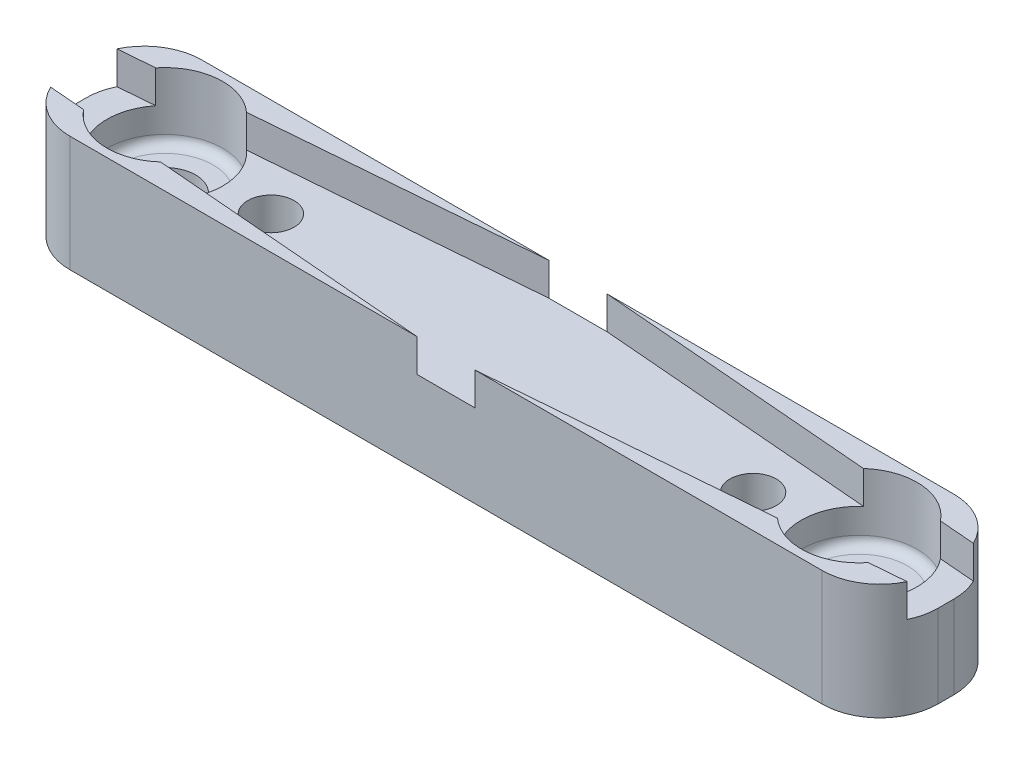
ISO-10303-21;
HEADER;
FILE_DESCRIPTION(('STEP AP214'),'2;1');
FILE_NAME('part.step','',(''),(''),'','','');
FILE_SCHEMA(('AUTOMOTIVE_DESIGN { 1 0 10303 214 1 1 1 1 }'));
ENDSEC;
DATA;
#1=APPLICATION_CONTEXT('core data for automotive mechanical design processes');
#2=APPLICATION_PROTOCOL_DEFINITION('international standard','automotive_design',2000,#1);
#3=PRODUCT_CONTEXT('',#1,'mechanical');
#4=PRODUCT('Part','Part','',(#3));
#5=PRODUCT_RELATED_PRODUCT_CATEGORY('part','',(#4));
#6=PRODUCT_DEFINITION_FORMATION('','',#4);
#7=PRODUCT_DEFINITION_CONTEXT('part definition',#1,'design');
#8=PRODUCT_DEFINITION('design','',#6,#7);
#9=PRODUCT_DEFINITION_SHAPE('','',#8);
#10=(LENGTH_UNIT() NAMED_UNIT(*) SI_UNIT(.MILLI.,.METRE.));
#11=(NAMED_UNIT(*) PLANE_ANGLE_UNIT() SI_UNIT($,.RADIAN.));
#12=(NAMED_UNIT(*) SI_UNIT($,.STERADIAN.) SOLID_ANGLE_UNIT());
#13=UNCERTAINTY_MEASURE_WITH_UNIT(LENGTH_MEASURE(1.E-05),#10,'distance_accuracy_value','');
#14=(GEOMETRIC_REPRESENTATION_CONTEXT(3) GLOBAL_UNCERTAINTY_ASSIGNED_CONTEXT((#13)) GLOBAL_UNIT_ASSIGNED_CONTEXT((#10,
#11,#12)) REPRESENTATION_CONTEXT('',''));
#15=CARTESIAN_POINT('',(0.,0.,0.));
#16=DIRECTION('',(0.,0.,1.));
#17=DIRECTION('',(1.,0.,0.));
#18=AXIS2_PLACEMENT_3D('',#15,#16,#17);
#19=CARTESIAN_POINT('',(-18.,6.,4.50000000346947));
#20=DIRECTION('',(0.,-1.,0.));
#21=DIRECTION('',(0.,0.,-1.));
#22=AXIS2_PLACEMENT_3D('',#19,#20,#21);
#23=CYLINDRICAL_SURFACE('',#22,1.6);
#24=CARTESIAN_POINT('',(-18.,0.,4.50000000346947));
#25=DIRECTION('',(0.,1.,0.));
#26=DIRECTION('',(0.,0.,1.));
#27=AXIS2_PLACEMENT_3D('',#24,#25,#26);
#28=CIRCLE('',#27,1.6);
#29=CARTESIAN_POINT('',(-18.,0.,6.10000000346947));
#30=VERTEX_POINT('',#29);
#31=EDGE_CURVE('E275',#30,#30,#28,.T.);
#32=ORIENTED_EDGE('',*,*,#31,.F.);
#33=EDGE_LOOP('',(#32));
#34=FACE_BOUND('',#33,.T.);
#35=CARTESIAN_POINT('',(-18.,2.5,4.50000000346947));
#36=DIRECTION('',(0.,1.,0.));
#37=DIRECTION('',(0.,0.,1.));
#38=AXIS2_PLACEMENT_3D('',#35,#36,#37);
#39=CIRCLE('',#38,1.6);
#40=CARTESIAN_POINT('',(-18.,2.5,6.10000000346947));
#41=VERTEX_POINT('',#40);
#42=EDGE_CURVE('E361',#41,#41,#39,.T.);
#43=ORIENTED_EDGE('',*,*,#42,.T.);
#44=EDGE_LOOP('',(#43));
#45=FACE_BOUND('',#44,.T.);
#46=ADVANCED_FACE('F36',(#34,#45),#23,.F.);
#47=CARTESIAN_POINT('',(18.,6.,4.50000000346948));
#48=DIRECTION('',(0.,-1.,0.));
#49=DIRECTION('',(0.,0.,-1.));
#50=AXIS2_PLACEMENT_3D('',#47,#48,#49);
#51=CYLINDRICAL_SURFACE('',#50,1.6);
#52=CARTESIAN_POINT('',(18.,0.,4.50000000346948));
#53=DIRECTION('',(0.,1.,0.));
#54=DIRECTION('',(0.,0.,-1.));
#55=AXIS2_PLACEMENT_3D('',#52,#53,#54);
#56=CIRCLE('',#55,1.6);
#57=CARTESIAN_POINT('',(18.,0.,2.90000000346948));
#58=VERTEX_POINT('',#57);
#59=EDGE_CURVE('E272',#58,#58,#56,.T.);
#60=ORIENTED_EDGE('',*,*,#59,.F.);
#61=EDGE_LOOP('',(#60));
#62=FACE_BOUND('',#61,.T.);
#63=CARTESIAN_POINT('',(18.,2.5,4.50000000346948));
#64=DIRECTION('',(0.,1.,0.));
#65=DIRECTION('',(0.,0.,1.));
#66=AXIS2_PLACEMENT_3D('',#63,#64,#65);
#67=CIRCLE('',#66,1.6);
#68=CARTESIAN_POINT('',(18.,2.5,6.10000000346948));
#69=VERTEX_POINT('',#68);
#70=EDGE_CURVE('E358',#69,#69,#67,.T.);
#71=ORIENTED_EDGE('',*,*,#70,.T.);
#72=EDGE_LOOP('',(#71));
#73=FACE_BOUND('',#72,.T.);
#74=ADVANCED_FACE('F399',(#62,#73),#51,.F.);
#75=CARTESIAN_POINT('',(0.,4.3,0.953841045118482));
#76=DIRECTION('',(0.0820399469741276,0.,-0.996629041870887));
#77=DIRECTION('',(-0.996629041870887,0.,-0.0820399469741276));
#78=AXIS2_PLACEMENT_3D('',#75,#76,#77);
#79=PLANE('',#78);
#80=DIRECTION('',(0.,-1.,0.));
#81=VECTOR('',#80,1.);
#82=CARTESIAN_POINT('',(20.3447254159373,6.,2.62856666940238));
#83=LINE('',#82,#81);
#84=CARTESIAN_POINT('',(20.3447254159373,4.3,2.62856666940238));
#85=VERTEX_POINT('',#84);
#86=CARTESIAN_POINT('',(20.3447254159373,6.,2.62856666940238));
#87=VERTEX_POINT('',#86);
#88=EDGE_CURVE('E212',#85,#87,#83,.F.);
#89=ORIENTED_EDGE('',*,*,#88,.F.);
#90=DIRECTION('',(-0.996629041870887,0.,-0.0820399469741276));
#91=VECTOR('',#90,1.);
#92=CARTESIAN_POINT('',(0.,4.3,0.953841045118482));
#93=LINE('',#92,#91);
#94=CARTESIAN_POINT('',(22.2051959465598,4.3,2.78171583249788));
#95=VERTEX_POINT('',#94);
#96=EDGE_CURVE('E603',#95,#85,#93,.T.);
#97=ORIENTED_EDGE('',*,*,#96,.F.);
#98=DIRECTION('',(0.,-1.,0.));
#99=VECTOR('',#98,1.);
#100=CARTESIAN_POINT('',(22.2051959465598,6.,2.78171583249788));
#101=LINE('',#100,#99);
#102=CARTESIAN_POINT('',(22.2051959465598,6.,2.78171583249788));
#103=VERTEX_POINT('',#102);
#104=EDGE_CURVE('E350',#95,#103,#101,.F.);
#105=ORIENTED_EDGE('',*,*,#104,.T.);
#106=DIRECTION('',(-0.996629041870887,0.,-0.0820399469741276));
#107=VECTOR('',#106,1.);
#108=CARTESIAN_POINT('',(0.,6.,0.953841045118482));
#109=LINE('',#108,#107);
#110=EDGE_CURVE('E566',#103,#87,#109,.T.);
#111=ORIENTED_EDGE('',*,*,#110,.T.);
#112=EDGE_LOOP('',(#89,#97,#105,#111));
#113=FACE_BOUND('',#112,.T.);
#114=ADVANCED_FACE('F405',(#113),#79,.F.);
#115=DIRECTION('',(0.,-1.,0.));
#116=VECTOR('',#115,1.);
#117=CARTESIAN_POINT('',(15.9928666620891,6.,2.27033281667982));
#118=LINE('',#117,#116);
#119=CARTESIAN_POINT('',(15.9928666620891,6.,2.27033281667982));
#120=VERTEX_POINT('',#119);
#121=CARTESIAN_POINT('',(15.9928666620891,4.3,2.27033281667982));
#122=VERTEX_POINT('',#121);
#123=EDGE_CURVE('E614',#120,#122,#118,.T.);
#124=ORIENTED_EDGE('',*,*,#123,.F.);
#125=CARTESIAN_POINT('',(1.51561331942348,6.,1.07860244693893));
#126=VERTEX_POINT('',#125);
#127=EDGE_CURVE('E365',#120,#126,#109,.T.);
#128=ORIENTED_EDGE('',*,*,#127,.T.);
#129=DIRECTION('',(0.,1.,0.));
#130=VECTOR('',#129,1.);
#131=CARTESIAN_POINT('',(1.51561331942346,6.,1.07860244693893));
#132=LINE('',#131,#130);
#133=CARTESIAN_POINT('',(1.51561331942348,4.3,1.07860244693893));
#134=VERTEX_POINT('',#133);
#135=EDGE_CURVE('E262',#134,#126,#132,.T.);
#136=ORIENTED_EDGE('',*,*,#135,.F.);
#137=EDGE_CURVE('E222',#122,#134,#93,.T.);
#138=ORIENTED_EDGE('',*,*,#137,.F.);
#139=EDGE_LOOP('',(#124,#128,#136,#138));
#140=FACE_BOUND('',#139,.T.);
#141=ADVANCED_FACE('F497',(#140),#79,.F.);
#142=CARTESIAN_POINT('',(43.079074710979,4.3,4.50000000346946));
#143=DIRECTION('',(0.0820399469741276,0.,0.996629041870887));
#144=DIRECTION('',(0.996629041870887,0.,-0.0820399469741276));
#145=AXIS2_PLACEMENT_3D('',#142,#143,#144);
#146=PLANE('',#145);
#147=DIRECTION('',(0.,-1.,0.));
#148=VECTOR('',#147,1.);
#149=CARTESIAN_POINT('',(15.992866662089,6.,6.72966719025912));
#150=LINE('',#149,#148);
#151=CARTESIAN_POINT('',(15.992866662089,4.3,6.72966719025912));
#152=VERTEX_POINT('',#151);
#153=CARTESIAN_POINT('',(15.992866662089,6.,6.72966719025912));
#154=VERTEX_POINT('',#153);
#155=EDGE_CURVE('E198',#152,#154,#150,.F.);
#156=ORIENTED_EDGE('',*,*,#155,.F.);
#157=DIRECTION('',(0.996629041870887,0.,-0.0820399469741276));
#158=VECTOR('',#157,1.);
#159=CARTESIAN_POINT('',(43.079074710979,4.3,4.50000000346946));
#160=LINE('',#159,#158);
#161=CARTESIAN_POINT('',(1.51561331942313,4.3,7.92139756000002));
#162=VERTEX_POINT('',#161);
#163=EDGE_CURVE('E232',#162,#152,#160,.T.);
#164=ORIENTED_EDGE('',*,*,#163,.F.);
#165=DIRECTION('',(0.,-1.,0.));
#166=VECTOR('',#165,1.);
#167=CARTESIAN_POINT('',(1.51561331942338,6.,7.92139756000001));
#168=LINE('',#167,#166);
#169=CARTESIAN_POINT('',(1.51561331942313,6.,7.92139756000002));
#170=VERTEX_POINT('',#169);
#171=EDGE_CURVE('E259',#170,#162,#168,.T.);
#172=ORIENTED_EDGE('',*,*,#171,.F.);
#173=DIRECTION('',(0.996629041870887,0.,-0.0820399469741276));
#174=VECTOR('',#173,1.);
#175=CARTESIAN_POINT('',(43.079074710979,6.,4.50000000346946));
#176=LINE('',#175,#174);
#177=EDGE_CURVE('E219',#170,#154,#176,.T.);
#178=ORIENTED_EDGE('',*,*,#177,.T.);
#179=EDGE_LOOP('',(#156,#164,#172,#178));
#180=FACE_BOUND('',#179,.T.);
#181=ADVANCED_FACE('F494',(#180),#146,.F.);
#182=DIRECTION('',(0.,-1.,0.));
#183=VECTOR('',#182,1.);
#184=CARTESIAN_POINT('',(20.3447254159373,6.,6.37143333753655));
#185=LINE('',#184,#183);
#186=CARTESIAN_POINT('',(20.3447254159373,6.,6.37143333753655));
#187=VERTEX_POINT('',#186);
#188=CARTESIAN_POINT('',(20.3447254159373,4.3,6.37143333753655));
#189=VERTEX_POINT('',#188);
#190=EDGE_CURVE('E59',#187,#189,#185,.T.);
#191=ORIENTED_EDGE('',*,*,#190,.F.);
#192=CARTESIAN_POINT('',(22.2051959465598,6.,6.21828417444105));
#193=VERTEX_POINT('',#192);
#194=EDGE_CURVE('E209',#187,#193,#176,.T.);
#195=ORIENTED_EDGE('',*,*,#194,.T.);
#196=DIRECTION('',(0.,-1.,0.));
#197=VECTOR('',#196,1.);
#198=CARTESIAN_POINT('',(22.2051959465598,6.,6.21828417444105));
#199=LINE('',#198,#197);
#200=CARTESIAN_POINT('',(22.2051959465598,4.3,6.21828417444105));
#201=VERTEX_POINT('',#200);
#202=EDGE_CURVE('E348',#193,#201,#199,.T.);
#203=ORIENTED_EDGE('',*,*,#202,.T.);
#204=EDGE_CURVE('E211',#189,#201,#160,.T.);
#205=ORIENTED_EDGE('',*,*,#204,.F.);
#206=EDGE_LOOP('',(#191,#195,#203,#205));
#207=FACE_BOUND('',#206,.T.);
#208=ADVANCED_FACE('F207',(#207),#146,.F.);
#209=CARTESIAN_POINT('',(0.,4.3,8.04615896182045));
#210=DIRECTION('',(-0.0820399469741273,0.,0.996629041870887));
#211=DIRECTION('',(0.996629041870887,0.,0.0820399469741273));
#212=AXIS2_PLACEMENT_3D('',#209,#210,#211);
#213=PLANE('',#212);
#214=DIRECTION('',(0.,-1.,0.));
#215=VECTOR('',#214,1.);
#216=CARTESIAN_POINT('',(-20.3447254159373,6.,6.37143333753655));
#217=LINE('',#216,#215);
#218=CARTESIAN_POINT('',(-20.3447254159373,4.3,6.37143333753655));
#219=VERTEX_POINT('',#218);
#220=CARTESIAN_POINT('',(-20.3447254159373,6.,6.37143333753655));
#221=VERTEX_POINT('',#220);
#222=EDGE_CURVE('E362',#219,#221,#217,.F.);
#223=ORIENTED_EDGE('',*,*,#222,.F.);
#224=DIRECTION('',(0.996629041870887,0.,0.0820399469741273));
#225=VECTOR('',#224,1.);
#226=CARTESIAN_POINT('',(0.,4.3,8.04615896182045));
#227=LINE('',#226,#225);
#228=CARTESIAN_POINT('',(-22.2051959465598,4.3,6.21828417444106));
#229=VERTEX_POINT('',#228);
#230=EDGE_CURVE('E557',#229,#219,#227,.T.);
#231=ORIENTED_EDGE('',*,*,#230,.F.);
#232=DIRECTION('',(0.,-1.,0.));
#233=VECTOR('',#232,1.);
#234=CARTESIAN_POINT('',(-22.2051959465598,6.,6.21828417444106));
#235=LINE('',#234,#233);
#236=CARTESIAN_POINT('',(-22.2051959465598,6.,6.21828417444106));
#237=VERTEX_POINT('',#236);
#238=EDGE_CURVE('E346',#229,#237,#235,.F.);
#239=ORIENTED_EDGE('',*,*,#238,.T.);
#240=DIRECTION('',(0.996629041870887,0.,0.0820399469741273));
#241=VECTOR('',#240,1.);
#242=CARTESIAN_POINT('',(0.,6.,8.04615896182045));
#243=LINE('',#242,#241);
#244=EDGE_CURVE('E220',#237,#221,#243,.T.);
#245=ORIENTED_EDGE('',*,*,#244,.T.);
#246=EDGE_LOOP('',(#223,#231,#239,#245));
#247=FACE_BOUND('',#246,.T.);
#248=ADVANCED_FACE('F499',(#247),#213,.F.);
#249=DIRECTION('',(0.,-1.,0.));
#250=VECTOR('',#249,1.);
#251=CARTESIAN_POINT('',(-15.9928666620891,6.,6.72966719025912));
#252=LINE('',#251,#250);
#253=CARTESIAN_POINT('',(-15.9928666620891,6.,6.72966719025912));
#254=VERTEX_POINT('',#253);
#255=CARTESIAN_POINT('',(-15.9928666620891,4.3,6.72966719025912));
#256=VERTEX_POINT('',#255);
#257=EDGE_CURVE('E51',#254,#256,#252,.T.);
#258=ORIENTED_EDGE('',*,*,#257,.F.);
#259=CARTESIAN_POINT('',(-1.51561331942348,6.,7.92139756));
#260=VERTEX_POINT('',#259);
#261=EDGE_CURVE('E224',#254,#260,#243,.T.);
#262=ORIENTED_EDGE('',*,*,#261,.T.);
#263=DIRECTION('',(0.,1.,0.));
#264=VECTOR('',#263,1.);
#265=CARTESIAN_POINT('',(-1.51561331942337,6.,7.92139756000001));
#266=LINE('',#265,#264);
#267=CARTESIAN_POINT('',(-1.51561331942348,4.3,7.92139756));
#268=VERTEX_POINT('',#267);
#269=EDGE_CURVE('E256',#268,#260,#266,.T.);
#270=ORIENTED_EDGE('',*,*,#269,.F.);
#271=EDGE_CURVE('E550',#256,#268,#227,.T.);
#272=ORIENTED_EDGE('',*,*,#271,.F.);
#273=EDGE_LOOP('',(#258,#262,#270,#272));
#274=FACE_BOUND('',#273,.T.);
#275=ADVANCED_FACE('F502',(#274),#213,.F.);
#276=CARTESIAN_POINT('',(-43.079074710979,4.3,4.50000000346948));
#277=DIRECTION('',(-0.082039946974128,0.,-0.996629041870887));
#278=DIRECTION('',(-0.996629041870887,0.,0.082039946974128));
#279=AXIS2_PLACEMENT_3D('',#276,#277,#278);
#280=PLANE('',#279);
#281=DIRECTION('',(0.,-1.,0.));
#282=VECTOR('',#281,1.);
#283=CARTESIAN_POINT('',(-15.9928666620891,6.,2.27033281667982));
#284=LINE('',#283,#282);
#285=CARTESIAN_POINT('',(-15.9928666620891,4.3,2.27033281667982));
#286=VERTEX_POINT('',#285);
#287=CARTESIAN_POINT('',(-15.9928666620891,6.,2.27033281667982));
#288=VERTEX_POINT('',#287);
#289=EDGE_CURVE('E613',#286,#288,#284,.F.);
#290=ORIENTED_EDGE('',*,*,#289,.F.);
#291=DIRECTION('',(-0.996629041870887,0.,0.082039946974128));
#292=VECTOR('',#291,1.);
#293=CARTESIAN_POINT('',(-43.079074710979,4.3,4.50000000346948));
#294=LINE('',#293,#292);
#295=CARTESIAN_POINT('',(-1.51561331942383,4.3,1.07860244693895));
#296=VERTEX_POINT('',#295);
#297=EDGE_CURVE('E553',#296,#286,#294,.T.);
#298=ORIENTED_EDGE('',*,*,#297,.F.);
#299=DIRECTION('',(0.,-1.,0.));
#300=VECTOR('',#299,1.);
#301=CARTESIAN_POINT('',(-1.51561331942346,6.,1.07860244693893));
#302=LINE('',#301,#300);
#303=CARTESIAN_POINT('',(-1.51561331942383,6.,1.07860244693895));
#304=VERTEX_POINT('',#303);
#305=EDGE_CURVE('E253',#304,#296,#302,.T.);
#306=ORIENTED_EDGE('',*,*,#305,.F.);
#307=DIRECTION('',(-0.996629041870887,0.,0.082039946974128));
#308=VECTOR('',#307,1.);
#309=CARTESIAN_POINT('',(-43.079074710979,6.,4.50000000346948));
#310=LINE('',#309,#308);
#311=EDGE_CURVE('E569',#304,#288,#310,.T.);
#312=ORIENTED_EDGE('',*,*,#311,.T.);
#313=EDGE_LOOP('',(#290,#298,#306,#312));
#314=FACE_BOUND('',#313,.T.);
#315=ADVANCED_FACE('F504',(#314),#280,.F.);
#316=DIRECTION('',(0.,-1.,0.));
#317=VECTOR('',#316,1.);
#318=CARTESIAN_POINT('',(-20.3447254159373,6.,2.62856666940239));
#319=LINE('',#318,#317);
#320=CARTESIAN_POINT('',(-20.3447254159373,6.,2.62856666940239));
#321=VERTEX_POINT('',#320);
#322=CARTESIAN_POINT('',(-20.3447254159373,4.3,2.62856666940239));
#323=VERTEX_POINT('',#322);
#324=EDGE_CURVE('E578',#321,#323,#319,.T.);
#325=ORIENTED_EDGE('',*,*,#324,.F.);
#326=CARTESIAN_POINT('',(-22.2051959465598,6.,2.78171583249789));
#327=VERTEX_POINT('',#326);
#328=EDGE_CURVE('E568',#321,#327,#310,.T.);
#329=ORIENTED_EDGE('',*,*,#328,.T.);
#330=DIRECTION('',(0.,-1.,0.));
#331=VECTOR('',#330,1.);
#332=CARTESIAN_POINT('',(-22.2051959465598,6.,2.78171583249789));
#333=LINE('',#332,#331);
#334=CARTESIAN_POINT('',(-22.2051959465598,4.3,2.78171583249789));
#335=VERTEX_POINT('',#334);
#336=EDGE_CURVE('E343',#327,#335,#333,.T.);
#337=ORIENTED_EDGE('',*,*,#336,.T.);
#338=EDGE_CURVE('E560',#323,#335,#294,.T.);
#339=ORIENTED_EDGE('',*,*,#338,.F.);
#340=EDGE_LOOP('',(#325,#329,#337,#339));
#341=FACE_BOUND('',#340,.T.);
#342=ADVANCED_FACE('F507',(#341),#280,.F.);
#343=CARTESIAN_POINT('',(0.,4.3,0.));
#344=DIRECTION('',(0.,-1.,0.));
#345=DIRECTION('',(0.,0.,-1.));
#346=AXIS2_PLACEMENT_3D('',#343,#344,#345);
#347=PLANE('',#346);
#348=CARTESIAN_POINT('',(-18.,4.3,4.50000000346947));
#349=DIRECTION('',(0.,-1.,0.));
#350=DIRECTION('',(0.,0.,-1.));
#351=AXIS2_PLACEMENT_3D('',#348,#349,#350);
#352=CIRCLE('',#351,3.);
#353=EDGE_CURVE('E357',#323,#219,#352,.F.);
#354=ORIENTED_EDGE('',*,*,#353,.F.);
#355=ORIENTED_EDGE('',*,*,#338,.T.);
#356=CARTESIAN_POINT('',(-19.5,4.3,4.07860244693893));
#357=DIRECTION('',(0.,-1.,0.));
#358=DIRECTION('',(0.,0.,-1.));
#359=AXIS2_PLACEMENT_3D('',#356,#357,#358);
#360=CIRCLE('',#359,3.);
#361=CARTESIAN_POINT('',(-22.5,4.3,4.07860244693893));
#362=VERTEX_POINT('',#361);
#363=EDGE_CURVE('E341',#335,#362,#360,.F.);
#364=ORIENTED_EDGE('',*,*,#363,.T.);
#365=DIRECTION('',(0.,0.,-1.));
#366=VECTOR('',#365,1.);
#367=CARTESIAN_POINT('',(-22.5,4.3,7.92139756));
#368=LINE('',#367,#366);
#369=CARTESIAN_POINT('',(-22.5,4.3,4.92139756000001));
#370=VERTEX_POINT('',#369);
#371=EDGE_CURVE('E228',#370,#362,#368,.T.);
#372=ORIENTED_EDGE('',*,*,#371,.F.);
#373=CARTESIAN_POINT('',(-19.5,4.3,4.92139756000001));
#374=DIRECTION('',(0.,-1.,0.));
#375=DIRECTION('',(0.,0.,-1.));
#376=AXIS2_PLACEMENT_3D('',#373,#374,#375);
#377=CIRCLE('',#376,3.);
#378=EDGE_CURVE('E231',#370,#229,#377,.F.);
#379=ORIENTED_EDGE('',*,*,#378,.T.);
#380=ORIENTED_EDGE('',*,*,#230,.T.);
#381=EDGE_LOOP('',(#354,#355,#364,#372,#379,#380));
#382=FACE_BOUND('',#381,.T.);
#383=ADVANCED_FACE('F492',(#382),#347,.F.);
#384=EDGE_CURVE('E355',#256,#286,#352,.F.);
#385=ORIENTED_EDGE('',*,*,#384,.F.);
#386=ORIENTED_EDGE('',*,*,#271,.T.);
#387=DIRECTION('',(-1.,0.,0.));
#388=VECTOR('',#387,1.);
#389=CARTESIAN_POINT('',(22.5,4.3,7.92139756));
#390=LINE('',#389,#388);
#391=EDGE_CURVE('E247',#162,#268,#390,.T.);
#392=ORIENTED_EDGE('',*,*,#391,.F.);
#393=ORIENTED_EDGE('',*,*,#163,.T.);
#394=CARTESIAN_POINT('',(18.,4.3,4.50000000346948));
#395=DIRECTION('',(0.,-1.,0.));
#396=DIRECTION('',(0.,0.,-1.));
#397=AXIS2_PLACEMENT_3D('',#394,#395,#396);
#398=CIRCLE('',#397,3.);
#399=EDGE_CURVE('E354',#122,#152,#398,.F.);
#400=ORIENTED_EDGE('',*,*,#399,.F.);
#401=ORIENTED_EDGE('',*,*,#137,.T.);
#402=DIRECTION('',(1.,0.,0.));
#403=VECTOR('',#402,1.);
#404=CARTESIAN_POINT('',(-3.90651580164027,4.3,1.07860244693893));
#405=LINE('',#404,#403);
#406=EDGE_CURVE('E244',#296,#134,#405,.T.);
#407=ORIENTED_EDGE('',*,*,#406,.F.);
#408=ORIENTED_EDGE('',*,*,#297,.T.);
#409=EDGE_LOOP('',(#385,#386,#392,#393,#400,#401,#407,#408));
#410=FACE_BOUND('',#409,.T.);
#411=CARTESIAN_POINT('',(12.5,4.3,4.50000000346947));
#412=DIRECTION('',(0.,-1.,0.));
#413=DIRECTION('',(0.,0.,-1.));
#414=AXIS2_PLACEMENT_3D('',#411,#412,#413);
#415=CIRCLE('',#414,1.2);
#416=CARTESIAN_POINT('',(12.5,4.3,3.30000000346947));
#417=VERTEX_POINT('',#416);
#418=EDGE_CURVE('E250',#417,#417,#415,.T.);
#419=ORIENTED_EDGE('',*,*,#418,.T.);
#420=EDGE_LOOP('',(#419));
#421=FACE_BOUND('',#420,.T.);
#422=CARTESIAN_POINT('',(-12.5,4.3,4.50000000346947));
#423=DIRECTION('',(0.,-1.,0.));
#424=DIRECTION('',(0.,0.,-1.));
#425=AXIS2_PLACEMENT_3D('',#422,#423,#424);
#426=CIRCLE('',#425,1.2);
#427=CARTESIAN_POINT('',(-12.5,4.3,3.30000000346947));
#428=VERTEX_POINT('',#427);
#429=EDGE_CURVE('E241',#428,#428,#426,.T.);
#430=ORIENTED_EDGE('',*,*,#429,.T.);
#431=EDGE_LOOP('',(#430));
#432=FACE_BOUND('',#431,.T.);
#433=ADVANCED_FACE('F493',(#410,#421,#432),#347,.F.);
#434=CARTESIAN_POINT('',(0.,6.,0.));
#435=DIRECTION('',(0.,-1.,0.));
#436=DIRECTION('',(0.,0.,-1.));
#437=AXIS2_PLACEMENT_3D('',#434,#435,#436);
#438=PLANE('',#437);
#439=CARTESIAN_POINT('',(18.,6.,4.50000000346948));
#440=DIRECTION('',(0.,1.,0.));
#441=DIRECTION('',(0.,0.,1.));
#442=AXIS2_PLACEMENT_3D('',#439,#440,#441);
#443=CIRCLE('',#442,3.);
#444=EDGE_CURVE('E203',#87,#120,#443,.T.);
#445=ORIENTED_EDGE('',*,*,#444,.F.);
#446=ORIENTED_EDGE('',*,*,#110,.F.);
#447=CARTESIAN_POINT('',(19.5,6.,4.07860244693893));
#448=DIRECTION('',(0.,-1.,0.));
#449=DIRECTION('',(0.,0.,-1.));
#450=AXIS2_PLACEMENT_3D('',#447,#448,#449);
#451=CIRCLE('',#450,3.);
#452=CARTESIAN_POINT('',(19.5,6.,1.07860244693893));
#453=VERTEX_POINT('',#452);
#454=EDGE_CURVE('E328',#103,#453,#451,.F.);
#455=ORIENTED_EDGE('',*,*,#454,.T.);
#456=DIRECTION('',(-1.,0.,0.));
#457=VECTOR('',#456,1.);
#458=CARTESIAN_POINT('',(-3.90651580164027,6.,1.07860244693893));
#459=LINE('',#458,#457);
#460=EDGE_CURVE('E280',#453,#126,#459,.T.);
#461=ORIENTED_EDGE('',*,*,#460,.T.);
#462=ORIENTED_EDGE('',*,*,#127,.F.);
#463=EDGE_LOOP('',(#445,#446,#455,#461,#462));
#464=FACE_BOUND('',#463,.T.);
#465=ADVANCED_FACE('F418',(#464),#438,.F.);
#466=EDGE_CURVE('E195',#154,#187,#443,.T.);
#467=ORIENTED_EDGE('',*,*,#466,.F.);
#468=ORIENTED_EDGE('',*,*,#177,.F.);
#469=DIRECTION('',(1.,0.,0.));
#470=VECTOR('',#469,1.);
#471=CARTESIAN_POINT('',(-3.90651580164027,6.,7.92139756000001));
#472=LINE('',#471,#470);
#473=CARTESIAN_POINT('',(19.5,6.,7.92139756000001));
#474=VERTEX_POINT('',#473);
#475=EDGE_CURVE('E283',#170,#474,#472,.T.);
#476=ORIENTED_EDGE('',*,*,#475,.T.);
#477=CARTESIAN_POINT('',(19.5,6.,4.92139756));
#478=DIRECTION('',(0.,-1.,0.));
#479=DIRECTION('',(0.,0.,-1.));
#480=AXIS2_PLACEMENT_3D('',#477,#478,#479);
#481=CIRCLE('',#480,3.);
#482=EDGE_CURVE('E218',#474,#193,#481,.F.);
#483=ORIENTED_EDGE('',*,*,#482,.T.);
#484=ORIENTED_EDGE('',*,*,#194,.F.);
#485=EDGE_LOOP('',(#467,#468,#476,#483,#484));
#486=FACE_BOUND('',#485,.T.);
#487=ADVANCED_FACE('F216',(#486),#438,.F.);
#488=CARTESIAN_POINT('',(-18.,6.,4.50000000346947));
#489=DIRECTION('',(0.,1.,0.));
#490=DIRECTION('',(0.,0.,1.));
#491=AXIS2_PLACEMENT_3D('',#488,#489,#490);
#492=CIRCLE('',#491,3.);
#493=EDGE_CURVE('E620',#221,#254,#492,.T.);
#494=ORIENTED_EDGE('',*,*,#493,.F.);
#495=ORIENTED_EDGE('',*,*,#244,.F.);
#496=CARTESIAN_POINT('',(-19.5,6.,4.92139756000001));
#497=DIRECTION('',(0.,-1.,0.));
#498=DIRECTION('',(0.,0.,-1.));
#499=AXIS2_PLACEMENT_3D('',#496,#497,#498);
#500=CIRCLE('',#499,3.);
#501=CARTESIAN_POINT('',(-19.5,6.,7.92139756));
#502=VERTEX_POINT('',#501);
#503=EDGE_CURVE('E325',#237,#502,#500,.F.);
#504=ORIENTED_EDGE('',*,*,#503,.T.);
#505=EDGE_CURVE('E285',#502,#260,#472,.T.);
#506=ORIENTED_EDGE('',*,*,#505,.T.);
#507=ORIENTED_EDGE('',*,*,#261,.F.);
#508=EDGE_LOOP('',(#494,#495,#504,#506,#507));
#509=FACE_BOUND('',#508,.T.);
#510=ADVANCED_FACE('F419',(#509),#438,.F.);
#511=CARTESIAN_POINT('',(12.5,6.,4.50000000346947));
#512=DIRECTION('',(0.,-1.,0.));
#513=DIRECTION('',(0.,0.,-1.));
#514=AXIS2_PLACEMENT_3D('',#511,#512,#513);
#515=CYLINDRICAL_SURFACE('',#514,1.2);
#516=ORIENTED_EDGE('',*,*,#418,.F.);
#517=EDGE_LOOP('',(#516));
#518=FACE_BOUND('',#517,.T.);
#519=CARTESIAN_POINT('',(12.5,1.,4.50000000346947));
#520=DIRECTION('',(0.,-1.,0.));
#521=DIRECTION('',(0.,0.,-1.));
#522=AXIS2_PLACEMENT_3D('',#519,#520,#521);
#523=CIRCLE('',#522,1.2);
#524=CARTESIAN_POINT('',(12.5,1.,3.30000000346947));
#525=VERTEX_POINT('',#524);
#526=EDGE_CURVE('E269',#525,#525,#523,.T.);
#527=ORIENTED_EDGE('',*,*,#526,.T.);
#528=EDGE_LOOP('',(#527));
#529=FACE_BOUND('',#528,.T.);
#530=ADVANCED_FACE('F416',(#518,#529),#515,.F.);
#531=EDGE_CURVE('E213',#288,#321,#492,.T.);
#532=ORIENTED_EDGE('',*,*,#531,.F.);
#533=ORIENTED_EDGE('',*,*,#311,.F.);
#534=CARTESIAN_POINT('',(-19.5,6.,1.07860244693893));
#535=VERTEX_POINT('',#534);
#536=EDGE_CURVE('E284',#304,#535,#459,.T.);
#537=ORIENTED_EDGE('',*,*,#536,.T.);
#538=CARTESIAN_POINT('',(-19.5,6.,4.07860244693893));
#539=DIRECTION('',(0.,-1.,0.));
#540=DIRECTION('',(0.,0.,-1.));
#541=AXIS2_PLACEMENT_3D('',#538,#539,#540);
#542=CIRCLE('',#541,3.);
#543=EDGE_CURVE('E322',#535,#327,#542,.F.);
#544=ORIENTED_EDGE('',*,*,#543,.T.);
#545=ORIENTED_EDGE('',*,*,#328,.F.);
#546=EDGE_LOOP('',(#532,#533,#537,#544,#545));
#547=FACE_BOUND('',#546,.T.);
#548=ADVANCED_FACE('F412',(#547),#438,.F.);
#549=CARTESIAN_POINT('',(0.,0.,0.));
#550=DIRECTION('',(0.,-1.,0.));
#551=DIRECTION('',(0.,0.,-1.));
#552=AXIS2_PLACEMENT_3D('',#549,#550,#551);
#553=PLANE('',#552);
#554=CARTESIAN_POINT('',(12.5,0.,4.50000000346947));
#555=DIRECTION('',(0.,-1.,0.));
#556=DIRECTION('',(0.,0.,-1.));
#557=AXIS2_PLACEMENT_3D('',#554,#555,#556);
#558=CIRCLE('',#557,3.);
#559=CARTESIAN_POINT('',(12.5,0.,1.50000000346947));
#560=VERTEX_POINT('',#559);
#561=EDGE_CURVE('E266',#560,#560,#558,.T.);
#562=ORIENTED_EDGE('',*,*,#561,.F.);
#563=EDGE_LOOP('',(#562));
#564=FACE_BOUND('',#563,.T.);
#565=CARTESIAN_POINT('',(-12.5,0.,4.50000000346947));
#566=DIRECTION('',(0.,-1.,0.));
#567=DIRECTION('',(0.,0.,1.));
#568=AXIS2_PLACEMENT_3D('',#565,#566,#567);
#569=CIRCLE('',#568,3.);
#570=CARTESIAN_POINT('',(-12.5,0.,7.50000000346947));
#571=VERTEX_POINT('',#570);
#572=EDGE_CURVE('E265',#571,#571,#569,.T.);
#573=ORIENTED_EDGE('',*,*,#572,.F.);
#574=EDGE_LOOP('',(#573));
#575=FACE_BOUND('',#574,.T.);
#576=ORIENTED_EDGE('',*,*,#31,.T.);
#577=EDGE_LOOP('',(#576));
#578=FACE_BOUND('',#577,.T.);
#579=DIRECTION('',(-1.,0.,0.));
#580=VECTOR('',#579,1.);
#581=CARTESIAN_POINT('',(-3.90651580164027,0.,1.07860244693893));
#582=LINE('',#581,#580);
#583=CARTESIAN_POINT('',(19.5,0.,1.07860244693893));
#584=VERTEX_POINT('',#583);
#585=CARTESIAN_POINT('',(-19.5,0.,1.07860244693893));
#586=VERTEX_POINT('',#585);
#587=EDGE_CURVE('E297',#584,#586,#582,.T.);
#588=ORIENTED_EDGE('',*,*,#587,.F.);
#589=CARTESIAN_POINT('',(19.5,0.,4.07860244693893));
#590=DIRECTION('',(0.,-1.,0.));
#591=DIRECTION('',(0.,0.,-1.));
#592=AXIS2_PLACEMENT_3D('',#589,#590,#591);
#593=CIRCLE('',#592,3.);
#594=CARTESIAN_POINT('',(22.5,0.,4.07860244693893));
#595=VERTEX_POINT('',#594);
#596=EDGE_CURVE('E315',#584,#595,#593,.T.);
#597=ORIENTED_EDGE('',*,*,#596,.T.);
#598=DIRECTION('',(0.,0.,-1.));
#599=VECTOR('',#598,1.);
#600=CARTESIAN_POINT('',(22.5,0.,7.92139756));
#601=LINE('',#600,#599);
#602=CARTESIAN_POINT('',(22.5,0.,4.92139756));
#603=VERTEX_POINT('',#602);
#604=EDGE_CURVE('E294',#603,#595,#601,.T.);
#605=ORIENTED_EDGE('',*,*,#604,.F.);
#606=CARTESIAN_POINT('',(19.5,0.,4.92139756));
#607=DIRECTION('',(0.,-1.,0.));
#608=DIRECTION('',(0.,0.,-1.));
#609=AXIS2_PLACEMENT_3D('',#606,#607,#608);
#610=CIRCLE('',#609,3.);
#611=CARTESIAN_POINT('',(19.5,0.,7.92139756));
#612=VERTEX_POINT('',#611);
#613=EDGE_CURVE('E313',#603,#612,#610,.T.);
#614=ORIENTED_EDGE('',*,*,#613,.T.);
#615=DIRECTION('',(1.,0.,0.));
#616=VECTOR('',#615,1.);
#617=CARTESIAN_POINT('',(22.5,0.,7.92139756));
#618=LINE('',#617,#616);
#619=CARTESIAN_POINT('',(-19.5,0.,7.92139756000001));
#620=VERTEX_POINT('',#619);
#621=EDGE_CURVE('E291',#620,#612,#618,.T.);
#622=ORIENTED_EDGE('',*,*,#621,.F.);
#623=CARTESIAN_POINT('',(-19.5,0.,4.92139756000001));
#624=DIRECTION('',(0.,-1.,0.));
#625=DIRECTION('',(0.,0.,-1.));
#626=AXIS2_PLACEMENT_3D('',#623,#624,#625);
#627=CIRCLE('',#626,3.);
#628=CARTESIAN_POINT('',(-22.5,0.,4.92139756000001));
#629=VERTEX_POINT('',#628);
#630=EDGE_CURVE('E311',#620,#629,#627,.T.);
#631=ORIENTED_EDGE('',*,*,#630,.T.);
#632=DIRECTION('',(0.,0.,1.));
#633=VECTOR('',#632,1.);
#634=CARTESIAN_POINT('',(-22.5,0.,7.92139756));
#635=LINE('',#634,#633);
#636=CARTESIAN_POINT('',(-22.5,0.,4.07860244693893));
#637=VERTEX_POINT('',#636);
#638=EDGE_CURVE('E279',#637,#629,#635,.T.);
#639=ORIENTED_EDGE('',*,*,#638,.F.);
#640=CARTESIAN_POINT('',(-19.5,0.,4.07860244693893));
#641=DIRECTION('',(0.,-1.,0.));
#642=DIRECTION('',(0.,0.,-1.));
#643=AXIS2_PLACEMENT_3D('',#640,#641,#642);
#644=CIRCLE('',#643,3.);
#645=EDGE_CURVE('E309',#637,#586,#644,.T.);
#646=ORIENTED_EDGE('',*,*,#645,.T.);
#647=EDGE_LOOP('',(#588,#597,#605,#614,#622,#631,#639,#646));
#648=FACE_BOUND('',#647,.T.);
#649=ORIENTED_EDGE('',*,*,#59,.T.);
#650=EDGE_LOOP('',(#649));
#651=FACE_BOUND('',#650,.T.);
#652=ADVANCED_FACE('F415',(#564,#575,#578,#648,#651),#553,.T.);
#653=CARTESIAN_POINT('',(-22.5,6.,7.92139756));
#654=DIRECTION('',(1.,0.,0.));
#655=DIRECTION('',(0.,0.,-1.));
#656=AXIS2_PLACEMENT_3D('',#653,#654,#655);
#657=PLANE('',#656);
#658=DIRECTION('',(0.,-1.,0.));
#659=VECTOR('',#658,1.);
#660=CARTESIAN_POINT('',(-22.5,6.,4.92139756000001));
#661=LINE('',#660,#659);
#662=EDGE_CURVE('E338',#629,#370,#661,.F.);
#663=ORIENTED_EDGE('',*,*,#662,.T.);
#664=ORIENTED_EDGE('',*,*,#371,.T.);
#665=DIRECTION('',(0.,-1.,0.));
#666=VECTOR('',#665,1.);
#667=CARTESIAN_POINT('',(-22.5,6.,4.07860244693893));
#668=LINE('',#667,#666);
#669=EDGE_CURVE('E336',#362,#637,#668,.T.);
#670=ORIENTED_EDGE('',*,*,#669,.T.);
#671=ORIENTED_EDGE('',*,*,#638,.T.);
#672=EDGE_LOOP('',(#663,#664,#670,#671));
#673=FACE_BOUND('',#672,.T.);
#674=ADVANCED_FACE('F422',(#673),#657,.F.);
#675=CARTESIAN_POINT('',(22.5,6.,7.92139756));
#676=DIRECTION('',(0.,0.,-1.));
#677=DIRECTION('',(-1.,0.,0.));
#678=AXIS2_PLACEMENT_3D('',#675,#676,#677);
#679=PLANE('',#678);
#680=ORIENTED_EDGE('',*,*,#475,.F.);
#681=ORIENTED_EDGE('',*,*,#171,.T.);
#682=ORIENTED_EDGE('',*,*,#391,.T.);
#683=ORIENTED_EDGE('',*,*,#269,.T.);
#684=ORIENTED_EDGE('',*,*,#505,.F.);
#685=DIRECTION('',(0.,-1.,0.));
#686=VECTOR('',#685,1.);
#687=CARTESIAN_POINT('',(-19.5,6.,7.92139756000001));
#688=LINE('',#687,#686);
#689=EDGE_CURVE('E330',#502,#620,#688,.T.);
#690=ORIENTED_EDGE('',*,*,#689,.T.);
#691=ORIENTED_EDGE('',*,*,#621,.T.);
#692=DIRECTION('',(0.,-1.,0.));
#693=VECTOR('',#692,1.);
#694=CARTESIAN_POINT('',(19.5,6.,7.92139756));
#695=LINE('',#694,#693);
#696=EDGE_CURVE('E333',#612,#474,#695,.F.);
#697=ORIENTED_EDGE('',*,*,#696,.T.);
#698=EDGE_LOOP('',(#680,#681,#682,#683,#684,#690,#691,#697));
#699=FACE_BOUND('',#698,.T.);
#700=ADVANCED_FACE('F432',(#699),#679,.F.);
#701=CARTESIAN_POINT('',(22.5,6.,7.92139756));
#702=DIRECTION('',(-1.,0.,0.));
#703=DIRECTION('',(0.,0.,1.));
#704=AXIS2_PLACEMENT_3D('',#701,#702,#703);
#705=PLANE('',#704);
#706=DIRECTION('',(0.,-1.,0.));
#707=VECTOR('',#706,1.);
#708=CARTESIAN_POINT('',(22.5,6.,4.07860244693893));
#709=LINE('',#708,#707);
#710=CARTESIAN_POINT('',(22.5,4.3,4.07860244693893));
#711=VERTEX_POINT('',#710);
#712=EDGE_CURVE('E319',#595,#711,#709,.F.);
#713=ORIENTED_EDGE('',*,*,#712,.T.);
#714=DIRECTION('',(0.,0.,1.));
#715=VECTOR('',#714,1.);
#716=CARTESIAN_POINT('',(22.5,4.3,7.92139756));
#717=LINE('',#716,#715);
#718=CARTESIAN_POINT('',(22.5,4.3,4.92139756));
#719=VERTEX_POINT('',#718);
#720=EDGE_CURVE('E236',#711,#719,#717,.T.);
#721=ORIENTED_EDGE('',*,*,#720,.T.);
#722=DIRECTION('',(0.,-1.,0.));
#723=VECTOR('',#722,1.);
#724=CARTESIAN_POINT('',(22.5,6.,4.92139756));
#725=LINE('',#724,#723);
#726=EDGE_CURVE('E317',#719,#603,#725,.T.);
#727=ORIENTED_EDGE('',*,*,#726,.T.);
#728=ORIENTED_EDGE('',*,*,#604,.T.);
#729=EDGE_LOOP('',(#713,#721,#727,#728));
#730=FACE_BOUND('',#729,.T.);
#731=ADVANCED_FACE('F428',(#730),#705,.F.);
#732=CARTESIAN_POINT('',(-3.90651580164027,6.,1.07860244693893));
#733=DIRECTION('',(0.,0.,1.));
#734=DIRECTION('',(1.,0.,0.));
#735=AXIS2_PLACEMENT_3D('',#732,#733,#734);
#736=PLANE('',#735);
#737=ORIENTED_EDGE('',*,*,#406,.T.);
#738=ORIENTED_EDGE('',*,*,#135,.T.);
#739=ORIENTED_EDGE('',*,*,#460,.F.);
#740=DIRECTION('',(0.,-1.,0.));
#741=VECTOR('',#740,1.);
#742=CARTESIAN_POINT('',(19.5,6.,1.07860244693893));
#743=LINE('',#742,#741);
#744=EDGE_CURVE('E306',#453,#584,#743,.T.);
#745=ORIENTED_EDGE('',*,*,#744,.T.);
#746=ORIENTED_EDGE('',*,*,#587,.T.);
#747=DIRECTION('',(0.,-1.,0.));
#748=VECTOR('',#747,1.);
#749=CARTESIAN_POINT('',(-19.5,6.,1.07860244693893));
#750=LINE('',#749,#748);
#751=EDGE_CURVE('E288',#586,#535,#750,.F.);
#752=ORIENTED_EDGE('',*,*,#751,.T.);
#753=ORIENTED_EDGE('',*,*,#536,.F.);
#754=ORIENTED_EDGE('',*,*,#305,.T.);
#755=EDGE_LOOP('',(#737,#738,#739,#745,#746,#752,#753,#754));
#756=FACE_BOUND('',#755,.T.);
#757=ADVANCED_FACE('F424',(#756),#736,.F.);
#758=CARTESIAN_POINT('',(-12.5,6.,4.50000000346947));
#759=DIRECTION('',(0.,-1.,0.));
#760=DIRECTION('',(0.,0.,-1.));
#761=AXIS2_PLACEMENT_3D('',#758,#759,#760);
#762=CYLINDRICAL_SURFACE('',#761,1.2);
#763=ORIENTED_EDGE('',*,*,#429,.F.);
#764=EDGE_LOOP('',(#763));
#765=FACE_BOUND('',#764,.T.);
#766=CARTESIAN_POINT('',(-12.5,1.,4.50000000346947));
#767=DIRECTION('',(0.,1.,0.));
#768=DIRECTION('',(0.,0.,1.));
#769=AXIS2_PLACEMENT_3D('',#766,#767,#768);
#770=CIRCLE('',#769,1.2);
#771=CARTESIAN_POINT('',(-12.5,1.,5.70000000346947));
#772=VERTEX_POINT('',#771);
#773=EDGE_CURVE('E276',#772,#772,#770,.T.);
#774=ORIENTED_EDGE('',*,*,#773,.F.);
#775=EDGE_LOOP('',(#774));
#776=FACE_BOUND('',#775,.T.);
#777=ADVANCED_FACE('F427',(#765,#776),#762,.F.);
#778=CARTESIAN_POINT('',(12.5,1.,4.50000000346947));
#779=DIRECTION('',(0.,-1.,0.));
#780=DIRECTION('',(0.,0.,-1.));
#781=AXIS2_PLACEMENT_3D('',#778,#779,#780);
#782=CYLINDRICAL_SURFACE('',#781,3.);
#783=CARTESIAN_POINT('',(12.5,0.5,4.50000000346947));
#784=DIRECTION('',(0.,-1.,0.));
#785=DIRECTION('',(0.,0.,-1.));
#786=AXIS2_PLACEMENT_3D('',#783,#784,#785);
#787=CIRCLE('',#786,3.);
#788=CARTESIAN_POINT('',(12.5,0.5,1.50000000346947));
#789=VERTEX_POINT('',#788);
#790=EDGE_CURVE('E11',#789,#789,#787,.F.);
#791=ORIENTED_EDGE('',*,*,#790,.T.);
#792=EDGE_LOOP('',(#791));
#793=FACE_BOUND('',#792,.T.);
#794=ORIENTED_EDGE('',*,*,#561,.T.);
#795=EDGE_LOOP('',(#794));
#796=FACE_BOUND('',#795,.T.);
#797=ADVANCED_FACE('F515',(#793,#796),#782,.F.);
#798=CARTESIAN_POINT('',(12.5,1.,4.50000000346947));
#799=DIRECTION('',(0.,-1.,0.));
#800=DIRECTION('',(0.,0.,-1.));
#801=AXIS2_PLACEMENT_3D('',#798,#799,#800);
#802=PLANE('',#801);
#803=CARTESIAN_POINT('',(12.5,1.,4.50000000346947));
#804=DIRECTION('',(0.,-1.,0.));
#805=DIRECTION('',(0.,0.,-1.));
#806=AXIS2_PLACEMENT_3D('',#803,#804,#805);
#807=CIRCLE('',#806,2.5);
#808=CARTESIAN_POINT('',(12.5,1.,2.00000000346947));
#809=VERTEX_POINT('',#808);
#810=EDGE_CURVE('E44',#809,#809,#807,.T.);
#811=ORIENTED_EDGE('',*,*,#810,.T.);
#812=EDGE_LOOP('',(#811));
#813=FACE_BOUND('',#812,.T.);
#814=ORIENTED_EDGE('',*,*,#526,.F.);
#815=EDGE_LOOP('',(#814));
#816=FACE_BOUND('',#815,.T.);
#817=ADVANCED_FACE('F386',(#813,#816),#802,.T.);
#818=CARTESIAN_POINT('',(-12.5,1.,4.50000000346947));
#819=DIRECTION('',(0.,-1.,0.));
#820=DIRECTION('',(0.,0.,-1.));
#821=AXIS2_PLACEMENT_3D('',#818,#819,#820);
#822=CYLINDRICAL_SURFACE('',#821,3.);
#823=CARTESIAN_POINT('',(-12.5,0.5,4.50000000346947));
#824=DIRECTION('',(0.,1.,0.));
#825=DIRECTION('',(0.,0.,1.));
#826=AXIS2_PLACEMENT_3D('',#823,#824,#825);
#827=CIRCLE('',#826,3.);
#828=CARTESIAN_POINT('',(-12.5,0.5,7.50000000346947));
#829=VERTEX_POINT('',#828);
#830=EDGE_CURVE('E381',#829,#829,#827,.T.);
#831=ORIENTED_EDGE('',*,*,#830,.T.);
#832=EDGE_LOOP('',(#831));
#833=FACE_BOUND('',#832,.T.);
#834=ORIENTED_EDGE('',*,*,#572,.T.);
#835=EDGE_LOOP('',(#834));
#836=FACE_BOUND('',#835,.T.);
#837=ADVANCED_FACE('F514',(#833,#836),#822,.F.);
#838=CARTESIAN_POINT('',(-12.5,1.,4.50000000346947));
#839=DIRECTION('',(0.,1.,0.));
#840=DIRECTION('',(0.,0.,1.));
#841=AXIS2_PLACEMENT_3D('',#838,#839,#840);
#842=PLANE('',#841);
#843=CARTESIAN_POINT('',(-12.5,1.,4.50000000346947));
#844=DIRECTION('',(0.,1.,0.));
#845=DIRECTION('',(0.,0.,1.));
#846=AXIS2_PLACEMENT_3D('',#843,#844,#845);
#847=CIRCLE('',#846,2.5);
#848=CARTESIAN_POINT('',(-12.5,1.,7.00000000346947));
#849=VERTEX_POINT('',#848);
#850=EDGE_CURVE('E378',#849,#849,#847,.F.);
#851=ORIENTED_EDGE('',*,*,#850,.T.);
#852=EDGE_LOOP('',(#851));
#853=FACE_BOUND('',#852,.T.);
#854=ORIENTED_EDGE('',*,*,#773,.T.);
#855=EDGE_LOOP('',(#854));
#856=FACE_BOUND('',#855,.T.);
#857=ADVANCED_FACE('F444',(#853,#856),#842,.F.);
#858=CARTESIAN_POINT('',(19.5,6.,4.07860244693893));
#859=DIRECTION('',(0.,-1.,0.));
#860=DIRECTION('',(0.,0.,-1.));
#861=AXIS2_PLACEMENT_3D('',#858,#859,#860);
#862=CYLINDRICAL_SURFACE('',#861,3.);
#863=ORIENTED_EDGE('',*,*,#104,.F.);
#864=CARTESIAN_POINT('',(19.5,4.3,4.07860244693893));
#865=DIRECTION('',(0.,-1.,0.));
#866=DIRECTION('',(0.,0.,-1.));
#867=AXIS2_PLACEMENT_3D('',#864,#865,#866);
#868=CIRCLE('',#867,3.);
#869=EDGE_CURVE('E239',#711,#95,#868,.F.);
#870=ORIENTED_EDGE('',*,*,#869,.F.);
#871=ORIENTED_EDGE('',*,*,#712,.F.);
#872=ORIENTED_EDGE('',*,*,#596,.F.);
#873=ORIENTED_EDGE('',*,*,#744,.F.);
#874=ORIENTED_EDGE('',*,*,#454,.F.);
#875=EDGE_LOOP('',(#863,#870,#871,#872,#873,#874));
#876=FACE_BOUND('',#875,.T.);
#877=ADVANCED_FACE('F440',(#876),#862,.T.);
#878=CARTESIAN_POINT('',(19.5,6.,4.92139756));
#879=DIRECTION('',(0.,-1.,0.));
#880=DIRECTION('',(0.,0.,-1.));
#881=AXIS2_PLACEMENT_3D('',#878,#879,#880);
#882=CYLINDRICAL_SURFACE('',#881,3.);
#883=ORIENTED_EDGE('',*,*,#202,.F.);
#884=ORIENTED_EDGE('',*,*,#482,.F.);
#885=ORIENTED_EDGE('',*,*,#696,.F.);
#886=ORIENTED_EDGE('',*,*,#613,.F.);
#887=ORIENTED_EDGE('',*,*,#726,.F.);
#888=CARTESIAN_POINT('',(19.5,4.3,4.92139756));
#889=DIRECTION('',(0.,-1.,0.));
#890=DIRECTION('',(0.,0.,-1.));
#891=AXIS2_PLACEMENT_3D('',#888,#889,#890);
#892=CIRCLE('',#891,3.);
#893=EDGE_CURVE('E234',#201,#719,#892,.F.);
#894=ORIENTED_EDGE('',*,*,#893,.F.);
#895=EDGE_LOOP('',(#883,#884,#885,#886,#887,#894));
#896=FACE_BOUND('',#895,.T.);
#897=ADVANCED_FACE('F443',(#896),#882,.T.);
#898=CARTESIAN_POINT('',(-19.5,6.,4.92139756000001));
#899=DIRECTION('',(0.,-1.,0.));
#900=DIRECTION('',(0.,0.,-1.));
#901=AXIS2_PLACEMENT_3D('',#898,#899,#900);
#902=CYLINDRICAL_SURFACE('',#901,3.);
#903=ORIENTED_EDGE('',*,*,#238,.F.);
#904=ORIENTED_EDGE('',*,*,#378,.F.);
#905=ORIENTED_EDGE('',*,*,#662,.F.);
#906=ORIENTED_EDGE('',*,*,#630,.F.);
#907=ORIENTED_EDGE('',*,*,#689,.F.);
#908=ORIENTED_EDGE('',*,*,#503,.F.);
#909=EDGE_LOOP('',(#903,#904,#905,#906,#907,#908));
#910=FACE_BOUND('',#909,.T.);
#911=ADVANCED_FACE('F448',(#910),#902,.T.);
#912=CARTESIAN_POINT('',(-19.5,6.,4.07860244693893));
#913=DIRECTION('',(0.,-1.,0.));
#914=DIRECTION('',(0.,0.,-1.));
#915=AXIS2_PLACEMENT_3D('',#912,#913,#914);
#916=CYLINDRICAL_SURFACE('',#915,3.);
#917=ORIENTED_EDGE('',*,*,#336,.F.);
#918=ORIENTED_EDGE('',*,*,#543,.F.);
#919=ORIENTED_EDGE('',*,*,#751,.F.);
#920=ORIENTED_EDGE('',*,*,#645,.F.);
#921=ORIENTED_EDGE('',*,*,#669,.F.);
#922=ORIENTED_EDGE('',*,*,#363,.F.);
#923=EDGE_LOOP('',(#917,#918,#919,#920,#921,#922));
#924=FACE_BOUND('',#923,.T.);
#925=ADVANCED_FACE('F452',(#924),#916,.T.);
#926=EDGE_CURVE('E352',#189,#85,#398,.F.);
#927=ORIENTED_EDGE('',*,*,#926,.F.);
#928=ORIENTED_EDGE('',*,*,#204,.T.);
#929=ORIENTED_EDGE('',*,*,#893,.T.);
#930=ORIENTED_EDGE('',*,*,#720,.F.);
#931=ORIENTED_EDGE('',*,*,#869,.T.);
#932=ORIENTED_EDGE('',*,*,#96,.T.);
#933=EDGE_LOOP('',(#927,#928,#929,#930,#931,#932));
#934=FACE_BOUND('',#933,.T.);
#935=ADVANCED_FACE('F456',(#934),#347,.F.);
#936=CARTESIAN_POINT('',(18.,6.,4.50000000346948));
#937=DIRECTION('',(0.,-1.,0.));
#938=DIRECTION('',(0.,0.,-1.));
#939=AXIS2_PLACEMENT_3D('',#936,#937,#938);
#940=CYLINDRICAL_SURFACE('',#939,3.);
#941=CARTESIAN_POINT('',(18.,3.,4.50000000346948));
#942=DIRECTION('',(0.,1.,0.));
#943=DIRECTION('',(0.,0.,1.));
#944=AXIS2_PLACEMENT_3D('',#941,#942,#943);
#945=CIRCLE('',#944,3.);
#946=CARTESIAN_POINT('',(18.,3.,7.50000000346947));
#947=VERTEX_POINT('',#946);
#948=EDGE_CURVE('E369',#947,#947,#945,.F.);
#949=ORIENTED_EDGE('',*,*,#948,.T.);
#950=EDGE_LOOP('',(#949));
#951=FACE_BOUND('',#950,.T.);
#952=ORIENTED_EDGE('',*,*,#123,.T.);
#953=ORIENTED_EDGE('',*,*,#399,.T.);
#954=ORIENTED_EDGE('',*,*,#155,.T.);
#955=ORIENTED_EDGE('',*,*,#466,.T.);
#956=ORIENTED_EDGE('',*,*,#190,.T.);
#957=ORIENTED_EDGE('',*,*,#926,.T.);
#958=ORIENTED_EDGE('',*,*,#88,.T.);
#959=ORIENTED_EDGE('',*,*,#444,.T.);
#960=EDGE_LOOP('',(#952,#953,#954,#955,#956,#957,#958,#959));
#961=FACE_BOUND('',#960,.T.);
#962=ADVANCED_FACE('F196',(#951,#961),#940,.F.);
#963=CARTESIAN_POINT('',(18.,2.5,4.50000000346948));
#964=DIRECTION('',(0.,1.,0.));
#965=DIRECTION('',(0.,0.,1.));
#966=AXIS2_PLACEMENT_3D('',#963,#964,#965);
#967=PLANE('',#966);
#968=CARTESIAN_POINT('',(18.,2.5,4.50000000346948));
#969=DIRECTION('',(0.,1.,0.));
#970=DIRECTION('',(0.,0.,1.));
#971=AXIS2_PLACEMENT_3D('',#968,#969,#970);
#972=CIRCLE('',#971,2.5);
#973=CARTESIAN_POINT('',(18.,2.5,7.00000000346947));
#974=VERTEX_POINT('',#973);
#975=EDGE_CURVE('E366',#974,#974,#972,.T.);
#976=ORIENTED_EDGE('',*,*,#975,.T.);
#977=EDGE_LOOP('',(#976));
#978=FACE_BOUND('',#977,.T.);
#979=ORIENTED_EDGE('',*,*,#70,.F.);
#980=EDGE_LOOP('',(#979));
#981=FACE_BOUND('',#980,.T.);
#982=ADVANCED_FACE('F479',(#978,#981),#967,.T.);
#983=CARTESIAN_POINT('',(-18.,6.,4.50000000346947));
#984=DIRECTION('',(0.,-1.,0.));
#985=DIRECTION('',(0.,0.,-1.));
#986=AXIS2_PLACEMENT_3D('',#983,#984,#985);
#987=CYLINDRICAL_SURFACE('',#986,3.);
#988=CARTESIAN_POINT('',(-18.,3.,4.50000000346947));
#989=DIRECTION('',(0.,1.,0.));
#990=DIRECTION('',(0.,0.,1.));
#991=AXIS2_PLACEMENT_3D('',#988,#989,#990);
#992=CIRCLE('',#991,3.);
#993=CARTESIAN_POINT('',(-18.,3.,7.50000000346947));
#994=VERTEX_POINT('',#993);
#995=EDGE_CURVE('E375',#994,#994,#992,.F.);
#996=ORIENTED_EDGE('',*,*,#995,.T.);
#997=EDGE_LOOP('',(#996));
#998=FACE_BOUND('',#997,.T.);
#999=ORIENTED_EDGE('',*,*,#222,.T.);
#1000=ORIENTED_EDGE('',*,*,#493,.T.);
#1001=ORIENTED_EDGE('',*,*,#257,.T.);
#1002=ORIENTED_EDGE('',*,*,#384,.T.);
#1003=ORIENTED_EDGE('',*,*,#289,.T.);
#1004=ORIENTED_EDGE('',*,*,#531,.T.);
#1005=ORIENTED_EDGE('',*,*,#324,.T.);
#1006=ORIENTED_EDGE('',*,*,#353,.T.);
#1007=EDGE_LOOP('',(#999,#1000,#1001,#1002,#1003,#1004,#1005,#1006));
#1008=FACE_BOUND('',#1007,.T.);
#1009=ADVANCED_FACE('F473',(#998,#1008),#987,.F.);
#1010=CARTESIAN_POINT('',(-18.,2.5,4.50000000346947));
#1011=DIRECTION('',(0.,1.,0.));
#1012=DIRECTION('',(0.,0.,1.));
#1013=AXIS2_PLACEMENT_3D('',#1010,#1011,#1012);
#1014=PLANE('',#1013);
#1015=CARTESIAN_POINT('',(-18.,2.5,4.50000000346947));
#1016=DIRECTION('',(0.,1.,0.));
#1017=DIRECTION('',(0.,0.,1.));
#1018=AXIS2_PLACEMENT_3D('',#1015,#1016,#1017);
#1019=CIRCLE('',#1018,2.5);
#1020=CARTESIAN_POINT('',(-18.,2.5,7.00000000346947));
#1021=VERTEX_POINT('',#1020);
#1022=EDGE_CURVE('E372',#1021,#1021,#1019,.T.);
#1023=ORIENTED_EDGE('',*,*,#1022,.T.);
#1024=EDGE_LOOP('',(#1023));
#1025=FACE_BOUND('',#1024,.T.);
#1026=ORIENTED_EDGE('',*,*,#42,.F.);
#1027=EDGE_LOOP('',(#1026));
#1028=FACE_BOUND('',#1027,.T.);
#1029=ADVANCED_FACE('F461',(#1025,#1028),#1014,.T.);
#1030=CARTESIAN_POINT('',(18.,3.,4.50000000346948));
#1031=DIRECTION('',(0.,1.,0.));
#1032=DIRECTION('',(0.,0.,1.));
#1033=AXIS2_PLACEMENT_3D('',#1030,#1031,#1032);
#1034=TOROIDAL_SURFACE('',#1033,2.5,0.5);
#1035=ORIENTED_EDGE('',*,*,#948,.F.);
#1036=EDGE_LOOP('',(#1035));
#1037=FACE_BOUND('',#1036,.T.);
#1038=ORIENTED_EDGE('',*,*,#975,.F.);
#1039=EDGE_LOOP('',(#1038));
#1040=FACE_BOUND('',#1039,.T.);
#1041=ADVANCED_FACE('F458',(#1037,#1040),#1034,.F.);
#1042=CARTESIAN_POINT('',(-18.,3.,4.50000000346947));
#1043=DIRECTION('',(0.,1.,0.));
#1044=DIRECTION('',(0.,0.,1.));
#1045=AXIS2_PLACEMENT_3D('',#1042,#1043,#1044);
#1046=TOROIDAL_SURFACE('',#1045,2.5,0.5);
#1047=ORIENTED_EDGE('',*,*,#995,.F.);
#1048=EDGE_LOOP('',(#1047));
#1049=FACE_BOUND('',#1048,.T.);
#1050=ORIENTED_EDGE('',*,*,#1022,.F.);
#1051=EDGE_LOOP('',(#1050));
#1052=FACE_BOUND('',#1051,.T.);
#1053=ADVANCED_FACE('F395',(#1049,#1052),#1046,.F.);
#1054=CARTESIAN_POINT('',(-12.5,0.5,4.50000000346947));
#1055=DIRECTION('',(0.,1.,0.));
#1056=DIRECTION('',(0.,0.,1.));
#1057=AXIS2_PLACEMENT_3D('',#1054,#1055,#1056);
#1058=TOROIDAL_SURFACE('',#1057,2.5,0.5);
#1059=ORIENTED_EDGE('',*,*,#830,.F.);
#1060=EDGE_LOOP('',(#1059));
#1061=FACE_BOUND('',#1060,.T.);
#1062=ORIENTED_EDGE('',*,*,#850,.F.);
#1063=EDGE_LOOP('',(#1062));
#1064=FACE_BOUND('',#1063,.T.);
#1065=ADVANCED_FACE('F390',(#1061,#1064),#1058,.F.);
#1066=CARTESIAN_POINT('',(12.5,0.5,4.50000000346947));
#1067=DIRECTION('',(0.,-1.,0.));
#1068=DIRECTION('',(0.,0.,-1.));
#1069=AXIS2_PLACEMENT_3D('',#1066,#1067,#1068);
#1070=TOROIDAL_SURFACE('',#1069,2.5,0.5);
#1071=ORIENTED_EDGE('',*,*,#790,.F.);
#1072=EDGE_LOOP('',(#1071));
#1073=FACE_BOUND('',#1072,.T.);
#1074=ORIENTED_EDGE('',*,*,#810,.F.);
#1075=EDGE_LOOP('',(#1074));
#1076=FACE_BOUND('',#1075,.T.);
#1077=ADVANCED_FACE('F38',(#1073,#1076),#1070,.F.);
#1078=CLOSED_SHELL('',(#46,#74,#114,#141,#181,#208,#248,#275,#315,#342,#383,#433,#465,#487,#510,
#530,#548,#652,#674,#700,#731,#757,#777,#797,#817,#837,#857,#877,#897,#911,#925,#935,#962,#982,
#1009,#1029,#1041,#1053,#1065,#1077));
#1079=MANIFOLD_SOLID_BREP('B2',#1078);
#1080=ADVANCED_BREP_SHAPE_REPRESENTATION('',(#18,#1079),#14);
#1081=SHAPE_DEFINITION_REPRESENTATION(#9,#1080);
ENDSEC;
END-ISO-10303-21;
